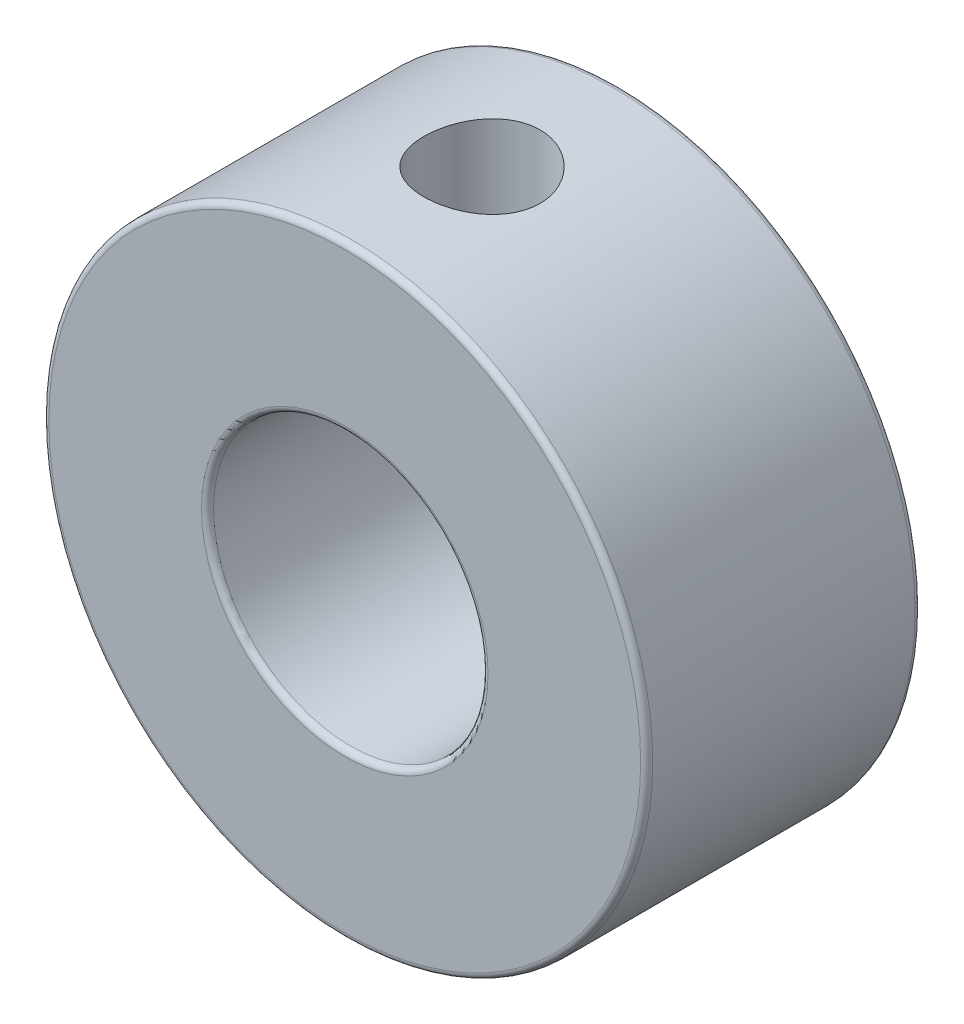
ISO-10303-21;
HEADER;
FILE_DESCRIPTION(('STEP AP214'),'2;1');
FILE_NAME('part.step','',(''),(''),'','','');
FILE_SCHEMA(('AUTOMOTIVE_DESIGN { 1 0 10303 214 1 1 1 1 }'));
ENDSEC;
DATA;
#1=APPLICATION_CONTEXT('core data for automotive mechanical design processes');
#2=APPLICATION_PROTOCOL_DEFINITION('international standard','automotive_design',2000,#1);
#3=PRODUCT_CONTEXT('',#1,'mechanical');
#4=PRODUCT('Part','Part','',(#3));
#5=PRODUCT_RELATED_PRODUCT_CATEGORY('part','',(#4));
#6=PRODUCT_DEFINITION_FORMATION('','',#4);
#7=PRODUCT_DEFINITION_CONTEXT('part definition',#1,'design');
#8=PRODUCT_DEFINITION('design','',#6,#7);
#9=PRODUCT_DEFINITION_SHAPE('','',#8);
#10=(LENGTH_UNIT() NAMED_UNIT(*) SI_UNIT(.MILLI.,.METRE.));
#11=(NAMED_UNIT(*) PLANE_ANGLE_UNIT() SI_UNIT($,.RADIAN.));
#12=(NAMED_UNIT(*) SI_UNIT($,.STERADIAN.) SOLID_ANGLE_UNIT());
#13=UNCERTAINTY_MEASURE_WITH_UNIT(LENGTH_MEASURE(1.E-05),#10,'distance_accuracy_value','');
#14=(GEOMETRIC_REPRESENTATION_CONTEXT(3) GLOBAL_UNCERTAINTY_ASSIGNED_CONTEXT((#13)) GLOBAL_UNIT_ASSIGNED_CONTEXT((#10,
#11,#12)) REPRESENTATION_CONTEXT('',''));
#15=CARTESIAN_POINT('',(0.,0.,0.));
#16=DIRECTION('',(0.,0.,1.));
#17=DIRECTION('',(1.,0.,0.));
#18=AXIS2_PLACEMENT_3D('',#15,#16,#17);
#19=CARTESIAN_POINT('',(0.,0.,0.22));
#20=DIRECTION('',(0.,0.,1.));
#21=DIRECTION('',(1.,0.,0.));
#22=AXIS2_PLACEMENT_3D('',#19,#20,#21);
#23=TOROIDAL_SURFACE('',#22,5.22,0.22);
#24=CARTESIAN_POINT('',(0.,0.,0.22));
#25=DIRECTION('',(0.,0.,-1.));
#26=DIRECTION('',(-1.,0.,0.));
#27=AXIS2_PLACEMENT_3D('',#24,#25,#26);
#28=CIRCLE('',#27,4.99999999999999);
#29=CARTESIAN_POINT('',(-4.99999999999999,0.,0.22));
#30=VERTEX_POINT('',#29);
#31=EDGE_CURVE('E145',#30,#30,#28,.F.);
#32=ORIENTED_EDGE('',*,*,#31,.T.);
#33=EDGE_LOOP('',(#32));
#34=FACE_BOUND('',#33,.T.);
#35=CARTESIAN_POINT('',(0.,0.,0.));
#36=DIRECTION('',(0.,0.,-1.));
#37=DIRECTION('',(1.,0.,0.));
#38=AXIS2_PLACEMENT_3D('',#35,#36,#37);
#39=CIRCLE('',#38,5.22);
#40=CARTESIAN_POINT('',(5.22,0.,0.));
#41=VERTEX_POINT('',#40);
#42=CARTESIAN_POINT('',(-5.22,0.,0.));
#43=VERTEX_POINT('',#42);
#44=EDGE_CURVE('E61',#41,#43,#39,.T.);
#45=ORIENTED_EDGE('',*,*,#44,.T.);
#46=CARTESIAN_POINT('',(0.,0.,0.));
#47=DIRECTION('',(0.,0.,-1.));
#48=DIRECTION('',(-1.,0.,0.));
#49=AXIS2_PLACEMENT_3D('',#46,#47,#48);
#50=CIRCLE('',#49,5.22);
#51=EDGE_CURVE('E64',#43,#41,#50,.T.);
#52=ORIENTED_EDGE('',*,*,#51,.T.);
#53=EDGE_LOOP('',(#45,#52));
#54=FACE_BOUND('',#53,.T.);
#55=ADVANCED_FACE('F17',(#34,#54),#23,.T.);
#56=CARTESIAN_POINT('',(0.,0.,9.78));
#57=DIRECTION('',(0.,0.,1.));
#58=DIRECTION('',(1.,0.,0.));
#59=AXIS2_PLACEMENT_3D('',#56,#57,#58);
#60=TOROIDAL_SURFACE('',#59,5.22,0.22);
#61=CARTESIAN_POINT('',(0.,0.,9.99999999999999));
#62=DIRECTION('',(0.,0.,1.));
#63=DIRECTION('',(1.,0.,0.));
#64=AXIS2_PLACEMENT_3D('',#61,#62,#63);
#65=CIRCLE('',#64,5.22);
#66=CARTESIAN_POINT('',(-5.22,0.,10.));
#67=VERTEX_POINT('',#66);
#68=CARTESIAN_POINT('',(5.22,0.,10.));
#69=VERTEX_POINT('',#68);
#70=EDGE_CURVE('E148',#67,#69,#65,.F.);
#71=ORIENTED_EDGE('',*,*,#70,.F.);
#72=CARTESIAN_POINT('',(0.,0.,9.99999999999999));
#73=DIRECTION('',(0.,0.,1.));
#74=DIRECTION('',(-1.,0.,0.));
#75=AXIS2_PLACEMENT_3D('',#72,#73,#74);
#76=CIRCLE('',#75,5.22);
#77=EDGE_CURVE('E68',#69,#67,#76,.F.);
#78=ORIENTED_EDGE('',*,*,#77,.F.);
#79=EDGE_LOOP('',(#71,#78));
#80=FACE_BOUND('',#79,.T.);
#81=CARTESIAN_POINT('',(0.,0.,9.78));
#82=DIRECTION('',(0.,0.,-1.));
#83=DIRECTION('',(-1.,0.,0.));
#84=AXIS2_PLACEMENT_3D('',#81,#82,#83);
#85=CIRCLE('',#84,4.99999999999999);
#86=CARTESIAN_POINT('',(-4.99999999999999,0.,9.78));
#87=VERTEX_POINT('',#86);
#88=EDGE_CURVE('E141',#87,#87,#85,.T.);
#89=ORIENTED_EDGE('',*,*,#88,.T.);
#90=EDGE_LOOP('',(#89));
#91=FACE_BOUND('',#90,.T.);
#92=ADVANCED_FACE('F92',(#80,#91),#60,.T.);
#93=CARTESIAN_POINT('',(0.,0.,0.));
#94=DIRECTION('',(0.,0.,1.));
#95=DIRECTION('',(1.,0.,0.));
#96=AXIS2_PLACEMENT_3D('',#93,#94,#95);
#97=PLANE('',#96);
#98=ORIENTED_EDGE('',*,*,#44,.F.);
#99=ORIENTED_EDGE('',*,*,#51,.F.);
#100=EDGE_LOOP('',(#98,#99));
#101=FACE_BOUND('',#100,.T.);
#102=CARTESIAN_POINT('',(0.,0.,0.));
#103=DIRECTION('',(0.,0.,1.));
#104=DIRECTION('',(1.,0.,0.));
#105=AXIS2_PLACEMENT_3D('',#102,#103,#104);
#106=CIRCLE('',#105,10.78);
#107=CARTESIAN_POINT('',(10.78,0.,0.));
#108=VERTEX_POINT('',#107);
#109=CARTESIAN_POINT('',(-10.78,0.,0.));
#110=VERTEX_POINT('',#109);
#111=EDGE_CURVE('E115',#108,#110,#106,.T.);
#112=ORIENTED_EDGE('',*,*,#111,.F.);
#113=CARTESIAN_POINT('',(0.,0.,0.));
#114=DIRECTION('',(0.,0.,1.));
#115=DIRECTION('',(-1.,0.,0.));
#116=AXIS2_PLACEMENT_3D('',#113,#114,#115);
#117=CIRCLE('',#116,10.78);
#118=EDGE_CURVE('E144',#110,#108,#117,.T.);
#119=ORIENTED_EDGE('',*,*,#118,.F.);
#120=EDGE_LOOP('',(#112,#119));
#121=FACE_BOUND('',#120,.T.);
#122=ADVANCED_FACE('F72',(#101,#121),#97,.F.);
#123=CARTESIAN_POINT('',(0.,0.,10.));
#124=DIRECTION('',(0.,0.,1.));
#125=DIRECTION('',(1.,0.,0.));
#126=AXIS2_PLACEMENT_3D('',#123,#124,#125);
#127=PLANE('',#126);
#128=ORIENTED_EDGE('',*,*,#77,.T.);
#129=ORIENTED_EDGE('',*,*,#70,.T.);
#130=EDGE_LOOP('',(#128,#129));
#131=FACE_BOUND('',#130,.T.);
#132=CARTESIAN_POINT('',(0.,0.,9.99999999999999));
#133=DIRECTION('',(0.,0.,-1.));
#134=DIRECTION('',(-1.,0.,0.));
#135=AXIS2_PLACEMENT_3D('',#132,#133,#134);
#136=CIRCLE('',#135,10.78);
#137=CARTESIAN_POINT('',(-10.78,0.,10.));
#138=VERTEX_POINT('',#137);
#139=CARTESIAN_POINT('',(10.78,0.,10.));
#140=VERTEX_POINT('',#139);
#141=EDGE_CURVE('E150',#138,#140,#136,.T.);
#142=ORIENTED_EDGE('',*,*,#141,.F.);
#143=CARTESIAN_POINT('',(0.,0.,9.99999999999999));
#144=DIRECTION('',(0.,0.,-1.));
#145=DIRECTION('',(1.,0.,0.));
#146=AXIS2_PLACEMENT_3D('',#143,#144,#145);
#147=CIRCLE('',#146,10.78);
#148=EDGE_CURVE('E40',#140,#138,#147,.T.);
#149=ORIENTED_EDGE('',*,*,#148,.F.);
#150=EDGE_LOOP('',(#142,#149));
#151=FACE_BOUND('',#150,.T.);
#152=ADVANCED_FACE('F91',(#131,#151),#127,.T.);
#153=CARTESIAN_POINT('',(0.,0.,10.));
#154=DIRECTION('',(0.,0.,-1.));
#155=DIRECTION('',(-1.,0.,0.));
#156=AXIS2_PLACEMENT_3D('',#153,#154,#155);
#157=CYLINDRICAL_SURFACE('',#156,4.99999999999999);
#158=ORIENTED_EDGE('',*,*,#31,.F.);
#159=EDGE_LOOP('',(#158));
#160=FACE_BOUND('',#159,.T.);
#161=CARTESIAN_POINT('',(2.117,4.5297142293968,4.99999999999999));
#162=CARTESIAN_POINT('',(2.11699309301691,4.52972153943462,4.88721988635963));
#163=CARTESIAN_POINT('',(2.10793520169226,4.53398496673945,4.77429545849873));
#164=CARTESIAN_POINT('',(2.07208496209444,4.55047601567057,4.55177011650102));
#165=CARTESIAN_POINT('',(2.04525594457135,4.56272010389422,4.44217656542255));
#166=CARTESIAN_POINT('',(1.97510144208162,4.59351965979582,4.22986158143605));
#167=CARTESIAN_POINT('',(1.93184089123746,4.61205025405856,4.12711494582499));
#168=CARTESIAN_POINT('',(1.83024786045405,4.65329853794864,3.9303495401743));
#169=CARTESIAN_POINT('',(1.77191635287303,4.67601595742045,3.83633020759234));
#170=CARTESIAN_POINT('',(1.63784012374558,4.72470613827744,3.65361847341939));
#171=CARTESIAN_POINT('',(1.56127961717617,4.75079140653768,3.56555444087989));
#172=CARTESIAN_POINT('',(1.39461852011726,4.8023581369116,3.40303958066179));
#173=CARTESIAN_POINT('',(1.30451131798914,4.82783929711315,3.32859543989702));
#174=CARTESIAN_POINT('',(1.10831397305362,4.87671083789647,3.19217219684342));
#175=CARTESIAN_POINT('',(1.00168385557286,4.89995373425115,3.1309126322717));
#176=CARTESIAN_POINT('',(0.778520215472691,4.94031423043762,3.02752133808708));
#177=CARTESIAN_POINT('',(0.661999282732184,4.95743947682855,2.9853657122861));
#178=CARTESIAN_POINT('',(0.454264477542442,4.98011271995247,2.93030217515929));
#179=CARTESIAN_POINT('',(0.364495371105773,4.98752388407147,2.9126100229639));
#180=CARTESIAN_POINT('',(0.183160042192702,4.99746853205254,2.88895818058655));
#181=CARTESIAN_POINT('',(0.0915941050666248,5.00000278417298,2.88299664248144));
#182=CARTESIAN_POINT('',(-0.113420485146392,4.99999655237363,2.88300415759706));
#183=CARTESIAN_POINT('',(-0.226884162266413,4.9961028805225,2.89215472808285));
#184=CARTESIAN_POINT('',(-0.450443181934993,4.98093213559266,2.92837357122442));
#185=CARTESIAN_POINT('',(-0.560535991244716,4.96964964571273,2.95545498928767));
#186=CARTESIAN_POINT('',(-0.773964848966353,4.94090571462919,3.02635342941826));
#187=CARTESIAN_POINT('',(-0.877318450701273,4.92346115294854,3.07012475922384));
#188=CARTESIAN_POINT('',(-1.07516266549124,4.88407765632574,3.17293852398243));
#189=CARTESIAN_POINT('',(-1.16965196381216,4.86213805622091,3.23198321938345));
#190=CARTESIAN_POINT('',(-1.35203075014299,4.81469692684949,3.36685531182628));
#191=CARTESIAN_POINT('',(-1.43940304854402,4.78907661928793,3.44333981056271));
#192=CARTESIAN_POINT('',(-1.60052174657625,4.73766769624089,3.60952374070588));
#193=CARTESIAN_POINT('',(-1.67426200068853,4.71187901024552,3.69922909967177));
#194=CARTESIAN_POINT('',(-1.80977006683084,4.66156936658985,3.8948799756914));
#195=CARTESIAN_POINT('',(-1.87073100485995,4.63718103609872,4.00142204084207));
#196=CARTESIAN_POINT('',(-1.97363562647853,4.59433266341178,4.22442993158717));
#197=CARTESIAN_POINT('',(-2.01558914610227,4.57586955645386,4.34089058731631));
#198=CARTESIAN_POINT('',(-2.07712583678651,4.54825701121241,4.57445380271504));
#199=CARTESIAN_POINT('',(-2.09770963979218,4.5386933897447,4.69124183201335));
#200=CARTESIAN_POINT('',(-2.11904241857867,4.52877605111293,4.92697537766699));
#201=CARTESIAN_POINT('',(-2.11980286480561,4.5284170078792,5.04591960649739));
#202=CARTESIAN_POINT('',(-2.10221911649558,4.53660007239404,5.27247067376917));
#203=CARTESIAN_POINT('',(-2.08539172272436,4.54443550900404,5.38022596245171));
#204=CARTESIAN_POINT('',(-2.03566048242402,4.56692710873765,5.59120840196308));
#205=CARTESIAN_POINT('',(-2.00275344659174,4.58158462495354,5.69443465005483));
#206=CARTESIAN_POINT('',(-1.92115122436903,4.61640278901674,5.89607904627664));
#207=CARTESIAN_POINT('',(-1.87213039837086,4.63667545527376,5.99434519842369));
#208=CARTESIAN_POINT('',(-1.75992315426729,4.68041566726508,6.18164721859362));
#209=CARTESIAN_POINT('',(-1.69673104759746,4.70388449449644,6.27067935889786));
#210=CARTESIAN_POINT('',(-1.5514845530152,4.75387078638039,6.4451890793311));
#211=CARTESIAN_POINT('',(-1.46826325389879,4.780475286103,6.52967330564435));
#212=CARTESIAN_POINT('',(-1.28857887989752,4.83200729891983,6.6838259475824));
#213=CARTESIAN_POINT('',(-1.1921125034216,4.85693439157221,6.75349065808444));
#214=CARTESIAN_POINT('',(-0.985573674831187,4.90307015018803,6.87754871604545));
#215=CARTESIAN_POINT('',(-0.875225435535698,4.92417256167516,6.93152537820764));
#216=CARTESIAN_POINT('',(-0.645892916857679,4.95946032305845,7.01979781562515));
#217=CARTESIAN_POINT('',(-0.526913626882313,4.97364963321969,7.05410486088714));
#218=CARTESIAN_POINT('',(-0.291986833836915,4.99276715198563,7.09995603364689));
#219=CARTESIAN_POINT('',(-0.176343383035808,4.99823644520318,7.11283249076462));
#220=CARTESIAN_POINT('',(0.0555726681911193,5.00103425035412,7.11944472609441));
#221=CARTESIAN_POINT('',(0.171845071667006,4.9983651783542,7.11318618498295));
#222=CARTESIAN_POINT('',(0.395395059301827,4.9855354368677,7.08264854441223));
#223=CARTESIAN_POINT('',(0.502827167156264,4.97576850945478,7.05931613552163));
#224=CARTESIAN_POINT('',(0.712127948862825,4.95015130026184,6.9966227283479));
#225=CARTESIAN_POINT('',(0.813995902386958,4.93430023295933,6.95725966030847));
#226=CARTESIAN_POINT('',(1.01286856933444,4.89741255497663,6.86233900001876));
#227=CARTESIAN_POINT('',(1.10962235051497,4.87622957163851,6.806314411126));
#228=CARTESIAN_POINT('',(1.29269761566395,4.83092545918196,6.68017591404685));
#229=CARTESIAN_POINT('',(1.37901527353015,4.80680325895315,6.61005686346819));
#230=CARTESIAN_POINT('',(1.54545008920232,4.75601749098684,6.45169499849921));
#231=CARTESIAN_POINT('',(1.62464514139129,4.72929745004737,6.3624988635746));
#232=CARTESIAN_POINT('',(1.76724427043038,4.67788524398689,6.17163653498633));
#233=CARTESIAN_POINT('',(1.83063821403188,4.65319438694846,6.06996240122898));
#234=CARTESIAN_POINT('',(1.94065099713382,4.60841341903916,5.85465131344963));
#235=CARTESIAN_POINT('',(1.98696424957426,4.58840925705182,5.7408394380595));
#236=CARTESIAN_POINT('',(2.0592710431973,4.55642424251714,5.50605123921171));
#237=CARTESIAN_POINT('',(2.08532225702598,4.54442063173802,5.38509631249835));
#238=CARTESIAN_POINT('',(2.10608369611038,4.53480233738941,5.21917459802516));
#239=CARTESIAN_POINT('',(2.1101722149078,4.53289996299048,5.17546909321446));
#240=CARTESIAN_POINT('',(2.11563175764398,4.53035446406299,5.08784969750205));
#241=CARTESIAN_POINT('',(2.11700269075651,4.52971138162208,5.04393579968467));
#242=CARTESIAN_POINT('',(2.117,4.5297142293968,4.99999999999999));
#243=B_SPLINE_CURVE_WITH_KNOTS('',3,(#161,#162,#163,#164,#165,#166,#167,#168,#169,#170,#171,
#172,#173,#174,#175,#176,#177,#178,#179,#180,#181,#182,#183,#184,#185,#186,#187,#188,#189,#190,
#191,#192,#193,#194,#195,#196,#197,#198,#199,#200,#201,#202,#203,#204,#205,#206,#207,#208,#209,
#210,#211,#212,#213,#214,#215,#216,#217,#218,#219,#220,#221,#222,#223,#224,#225,#226,#227,#228,
#229,#230,#231,#232,#233,#234,#235,#236,#237,#238,#239,#240,#241,#242),.UNSPECIFIED.,.T.,.F.,(4,
2,2,2,2,2,2,2,2,2,2,2,2,2,2,2,2,2,2,2,2,2,2,2,2,2,2,2,2,2,2,2,2,2,2,2,2,2,2,2,4),(0.,
0.338161635212298,0.677023221751606,1.0145593976317,1.35207380155897,1.70922896367033,
2.0665590092595,2.44011525297632,2.81320293481143,3.08774617516185,3.36224616326372,
3.7021580145837,4.04231933735749,4.38155600443103,4.72084290706114,5.0760383914423,
5.43139361456573,5.80495356830336,6.1783199893336,6.53328474150135,6.88804409482854,
7.21454797771787,7.54111664705017,7.87473848730187,8.20849448883981,8.57146595511042,
8.93452806383905,9.30649919517148,9.67825698644081,10.025897485495,10.3734347892729,
10.7030360772372,11.0326799343015,11.3726097612012,11.7126638380275,12.0777129569542,
12.4429955829594,12.8145283165315,13.1849996318331,13.3167330097495,13.44847079034),.UNSPECIFIED.);
#244=CARTESIAN_POINT('',(2.117,4.5297142293968,4.99999999999999));
#245=VERTEX_POINT('',#244);
#246=EDGE_CURVE('E22',#245,#245,#243,.T.);
#247=ORIENTED_EDGE('',*,*,#246,.T.);
#248=EDGE_LOOP('',(#247));
#249=FACE_BOUND('',#248,.T.);
#250=ORIENTED_EDGE('',*,*,#88,.F.);
#251=EDGE_LOOP('',(#250));
#252=FACE_BOUND('',#251,.T.);
#253=ADVANCED_FACE('F132',(#160,#249,#252),#157,.F.);
#254=CARTESIAN_POINT('',(0.,0.,0.22));
#255=DIRECTION('',(0.,0.,1.));
#256=DIRECTION('',(1.,0.,0.));
#257=AXIS2_PLACEMENT_3D('',#254,#255,#256);
#258=TOROIDAL_SURFACE('',#257,10.78,0.22);
#259=ORIENTED_EDGE('',*,*,#111,.T.);
#260=ORIENTED_EDGE('',*,*,#118,.T.);
#261=EDGE_LOOP('',(#259,#260));
#262=FACE_BOUND('',#261,.T.);
#263=CARTESIAN_POINT('',(0.,0.,0.22));
#264=DIRECTION('',(0.,0.,-1.));
#265=DIRECTION('',(-1.,0.,0.));
#266=AXIS2_PLACEMENT_3D('',#263,#264,#265);
#267=CIRCLE('',#266,11.);
#268=CARTESIAN_POINT('',(-11.,0.,0.22));
#269=VERTEX_POINT('',#268);
#270=EDGE_CURVE('E209',#269,#269,#267,.F.);
#271=ORIENTED_EDGE('',*,*,#270,.F.);
#272=EDGE_LOOP('',(#271));
#273=FACE_BOUND('',#272,.T.);
#274=ADVANCED_FACE('F121',(#262,#273),#258,.T.);
#275=CARTESIAN_POINT('',(0.,0.,9.78));
#276=DIRECTION('',(0.,0.,1.));
#277=DIRECTION('',(1.,0.,0.));
#278=AXIS2_PLACEMENT_3D('',#275,#276,#277);
#279=TOROIDAL_SURFACE('',#278,10.78,0.22);
#280=CARTESIAN_POINT('',(0.,0.,9.78));
#281=DIRECTION('',(0.,0.,-1.));
#282=DIRECTION('',(-1.,0.,0.));
#283=AXIS2_PLACEMENT_3D('',#280,#281,#282);
#284=CIRCLE('',#283,11.);
#285=CARTESIAN_POINT('',(-11.,0.,9.78));
#286=VERTEX_POINT('',#285);
#287=EDGE_CURVE('E33',#286,#286,#284,.T.);
#288=ORIENTED_EDGE('',*,*,#287,.F.);
#289=EDGE_LOOP('',(#288));
#290=FACE_BOUND('',#289,.T.);
#291=ORIENTED_EDGE('',*,*,#148,.T.);
#292=ORIENTED_EDGE('',*,*,#141,.T.);
#293=EDGE_LOOP('',(#291,#292));
#294=FACE_BOUND('',#293,.T.);
#295=ADVANCED_FACE('F131',(#290,#294),#279,.T.);
#296=CARTESIAN_POINT('',(0.,-7.07106781186548,4.99999999999999));
#297=DIRECTION('',(0.,1.,0.));
#298=DIRECTION('',(0.,0.,1.));
#299=AXIS2_PLACEMENT_3D('',#296,#297,#298);
#300=CYLINDRICAL_SURFACE('',#299,2.117);
#301=CARTESIAN_POINT('',(2.117,10.7943647798284,4.99999999999999));
#302=CARTESIAN_POINT('',(2.11699487277549,10.7943674185304,5.11770494033859));
#303=CARTESIAN_POINT('',(2.10714851222091,10.7963112958032,5.23548180119815));
#304=CARTESIAN_POINT('',(2.06804659093535,10.8038680047802,5.46772648645513));
#305=CARTESIAN_POINT('',(2.03877105776757,10.8094846118209,5.58219077916964));
#306=CARTESIAN_POINT('',(1.96174684742613,10.8237272743398,5.80439225570249));
#307=CARTESIAN_POINT('',(1.91401728441609,10.8323502150372,5.91213626653896));
#308=CARTESIAN_POINT('',(1.80148940882948,10.8516302778679,6.11807702561938));
#309=CARTESIAN_POINT('',(1.73669300365636,10.8622871726483,6.21627483907573));
#310=CARTESIAN_POINT('',(1.59096341507003,10.8845908366379,6.40163666317739));
#311=CARTESIAN_POINT('',(1.50984933970759,10.8962477772281,6.48865725850096));
#312=CARTESIAN_POINT('',(1.33417734397451,10.9191484425893,6.64794412240343));
#313=CARTESIAN_POINT('',(1.23961842184201,10.9303921364911,6.72020929059219));
#314=CARTESIAN_POINT('',(1.03879807774057,10.9513084064568,6.84848446557379));
#315=CARTESIAN_POINT('',(0.932448668735944,10.9609676219655,6.90435909007123));
#316=CARTESIAN_POINT('',(0.711654963572624,10.9775128006179,6.99739426538379));
#317=CARTESIAN_POINT('',(0.597211374555394,10.9843990056724,7.0345564486986));
#318=CARTESIAN_POINT('',(0.36496269282221,10.9945505426024,7.08866792272376));
#319=CARTESIAN_POINT('',(0.247215803854946,10.9978591136996,7.10585877999828));
#320=CARTESIAN_POINT('',(0.010465807797356,11.000631747906,7.12029268291297));
#321=CARTESIAN_POINT('',(-0.108537185611577,11.000096155995,7.11753751853335));
#322=CARTESIAN_POINT('',(-0.342763385642094,10.9952744931642,7.09234207275949));
#323=CARTESIAN_POINT('',(-0.458015744864514,10.991037989474,7.07016194484687));
#324=CARTESIAN_POINT('',(-0.683131615430486,10.9793462289311,7.00715809437346));
#325=CARTESIAN_POINT('',(-0.792994921639304,10.9718908496574,6.96633366272468));
#326=CARTESIAN_POINT('',(-1.00496380559956,10.9545166296322,6.86695486070823));
#327=CARTESIAN_POINT('',(-1.10701978735333,10.9445835137021,6.80829730278493));
#328=CARTESIAN_POINT('',(-1.29993706321016,10.9233509732644,6.67499348613771));
#329=CARTESIAN_POINT('',(-1.39079716026257,10.9120514029126,6.60034552007093));
#330=CARTESIAN_POINT('',(-1.56028587308879,10.8891208420196,6.43574875735677));
#331=CARTESIAN_POINT('',(-1.63869325826072,10.8774874462109,6.34557232741568));
#332=CARTESIAN_POINT('',(-1.77930621043553,10.8553742990985,6.15323451425738));
#333=CARTESIAN_POINT('',(-1.84151151074626,10.8448945667861,6.05107293380043));
#334=CARTESIAN_POINT('',(-1.94802269334238,10.8262713128027,5.83736201533584));
#335=CARTESIAN_POINT('',(-1.99229500009539,10.81813218157,5.72579553604901));
#336=CARTESIAN_POINT('',(-2.0614029960842,10.8051777543689,5.49661542460297));
#337=CARTESIAN_POINT('',(-2.08624102489843,10.8003620583198,5.37900252215436));
#338=CARTESIAN_POINT('',(-2.11544946678012,10.7946789692599,5.14306700724643));
#339=CARTESIAN_POINT('',(-2.12013835646063,10.7937501466764,5.02478525945672));
#340=CARTESIAN_POINT('',(-2.10977040993569,10.7957813876472,4.7891292008104));
#341=CARTESIAN_POINT('',(-2.09471459746687,10.7987412495785,4.67175484322419));
#342=CARTESIAN_POINT('',(-2.04555850972132,10.8081590098899,4.44230180675137));
#343=CARTESIAN_POINT('',(-2.01162647789952,10.814585990791,4.33018570138057));
#344=CARTESIAN_POINT('',(-1.92586007435225,10.8301870425539,4.11322968759248));
#345=CARTESIAN_POINT('',(-1.87402425601043,10.8393613353892,4.00839036795788));
#346=CARTESIAN_POINT('',(-1.75319241917323,10.8595625871269,3.80756357152745));
#347=CARTESIAN_POINT('',(-1.68399571618744,10.87061068521,3.71169900670924));
#348=CARTESIAN_POINT('',(-1.53067893727696,10.8932553977848,3.53282955037853));
#349=CARTESIAN_POINT('',(-1.44655792035624,10.9048520468295,3.44982547035369));
#350=CARTESIAN_POINT('',(-1.26435796654965,10.9274848915709,3.29783787719892));
#351=CARTESIAN_POINT('',(-1.16609943418309,10.9385109166255,3.22906786859156));
#352=CARTESIAN_POINT('',(-0.959228014316681,10.9585889652183,3.10900105104359));
#353=CARTESIAN_POINT('',(-0.850613714287824,10.9676407189102,3.05770663015339));
#354=CARTESIAN_POINT('',(-0.620686538317424,10.9831064738319,2.97214679684024));
#355=CARTESIAN_POINT('',(-0.499014597044771,10.9893733440974,2.93881485317572));
#356=CARTESIAN_POINT('',(-0.251555527434757,10.9978193938264,2.89424376383301));
#357=CARTESIAN_POINT('',(-0.125768899515505,10.999999068498,2.88300194168927));
#358=CARTESIAN_POINT('',(0.117847988107907,11.0000008728361,2.88299818059809));
#359=CARTESIAN_POINT('',(0.23568041055877,10.9980887945993,2.89286505139942));
#360=CARTESIAN_POINT('',(0.467941154951457,10.9906564332054,2.93200947819117));
#361=CARTESIAN_POINT('',(0.582370006022137,10.9851367140001,2.96128400035858));
#362=CARTESIAN_POINT('',(0.804553481274161,10.9711025639315,3.03831611453727));
#363=CARTESIAN_POINT('',(0.912311496082348,10.9625896693721,3.08606422588797));
#364=CARTESIAN_POINT('',(1.11829804338938,10.9434968114834,3.19864562412139));
#365=CARTESIAN_POINT('',(1.21652575077097,10.932916669414,3.2634803885338));
#366=CARTESIAN_POINT('',(1.40186925921566,10.9107096077433,3.40924365706184));
#367=CARTESIAN_POINT('',(1.48884958639782,10.8990723707144,3.49034284546083));
#368=CARTESIAN_POINT('',(1.6480751692454,10.876136080326,3.66598715300989));
#369=CARTESIAN_POINT('',(1.72031665062729,10.8648371142206,3.76053570574271));
#370=CARTESIAN_POINT('',(1.84859726947475,10.8437522915732,3.96139261313218));
#371=CARTESIAN_POINT('',(1.90448807101082,10.8339806411538,4.06779722516981));
#372=CARTESIAN_POINT('',(1.99749062394389,10.8172216860335,4.28863399889547));
#373=CARTESIAN_POINT('',(2.03462370695975,10.8102312204498,4.40305687260614));
#374=CARTESIAN_POINT('',(2.08012925225446,10.8015458231842,4.59840278868803));
#375=CARTESIAN_POINT('',(2.09393432354393,10.798866979799,4.67805905068021));
#376=CARTESIAN_POINT('',(2.1123713694787,10.795275569446,4.83846559642336));
#377=CARTESIAN_POINT('',(2.11700351895532,10.7943629688145,4.91921585929368));
#378=CARTESIAN_POINT('',(2.117,10.7943647798284,4.99999999999999));
#379=B_SPLINE_CURVE_WITH_KNOTS('',3,(#301,#302,#303,#304,#305,#306,#307,#308,#309,#310,#311,
#312,#313,#314,#315,#316,#317,#318,#319,#320,#321,#322,#323,#324,#325,#326,#327,#328,#329,#330,
#331,#332,#333,#334,#335,#336,#337,#338,#339,#340,#341,#342,#343,#344,#345,#346,#347,#348,#349,
#350,#351,#352,#353,#354,#355,#356,#357,#358,#359,#360,#361,#362,#363,#364,#365,#366,#367,#368,
#369,#370,#371,#372,#373,#374,#375,#376,#377,#378),.UNSPECIFIED.,.T.,.F.,(4,2,2,2,2,2,2,2,2,2,2,
2,2,2,2,2,2,2,2,2,2,2,2,2,2,2,2,2,2,2,2,2,2,2,2,2,2,2,4),(0.,0.3528174141241,0.70599807381206,
1.05881389471009,1.41159030135829,1.76851740157563,2.12547111001808,2.48529512512891,
2.84508774324525,3.20048156366309,3.55584349100307,3.90651770071028,4.25720524851725,
4.60996189383834,4.96275622281343,5.32124803647963,5.67974575067695,6.03891160348024,
6.39803421176316,6.75145916509912,7.1048657945444,7.4551718484508,7.80550621352228,
8.16009362022053,8.51470339203401,8.87429825751721,9.23394224218128,9.61081462945848,
9.98764135161002,10.3407355683991,10.6937746021662,11.0466326958359,11.3995213121288,
11.7563277641933,12.1132254719167,12.4732671661478,12.8328984874093,13.0750514063499,
13.3171997099321),.UNSPECIFIED.);
#380=CARTESIAN_POINT('',(2.117,10.7943647798284,4.99999999999999));
#381=VERTEX_POINT('',#380);
#382=EDGE_CURVE('E11',#381,#381,#379,.T.);
#383=ORIENTED_EDGE('',*,*,#382,.F.);
#384=EDGE_LOOP('',(#383));
#385=FACE_BOUND('',#384,.T.);
#386=ORIENTED_EDGE('',*,*,#246,.F.);
#387=EDGE_LOOP('',(#386));
#388=FACE_BOUND('',#387,.T.);
#389=ADVANCED_FACE('F218',(#385,#388),#300,.F.);
#390=CARTESIAN_POINT('',(0.,0.,10.));
#391=DIRECTION('',(0.,0.,-1.));
#392=DIRECTION('',(-1.,0.,0.));
#393=AXIS2_PLACEMENT_3D('',#390,#391,#392);
#394=CYLINDRICAL_SURFACE('',#393,11.);
#395=ORIENTED_EDGE('',*,*,#287,.T.);
#396=EDGE_LOOP('',(#395));
#397=FACE_BOUND('',#396,.T.);
#398=ORIENTED_EDGE('',*,*,#382,.T.);
#399=EDGE_LOOP('',(#398));
#400=FACE_BOUND('',#399,.T.);
#401=ORIENTED_EDGE('',*,*,#270,.T.);
#402=EDGE_LOOP('',(#401));
#403=FACE_BOUND('',#402,.T.);
#404=ADVANCED_FACE('F220',(#397,#400,#403),#394,.T.);
#405=CLOSED_SHELL('',(#55,#92,#122,#152,#253,#274,#295,#389,#404));
#406=MANIFOLD_SOLID_BREP('B1',#405);
#407=ADVANCED_BREP_SHAPE_REPRESENTATION('',(#18,#406),#14);
#408=SHAPE_DEFINITION_REPRESENTATION(#9,#407);
ENDSEC;
END-ISO-10303-21;
